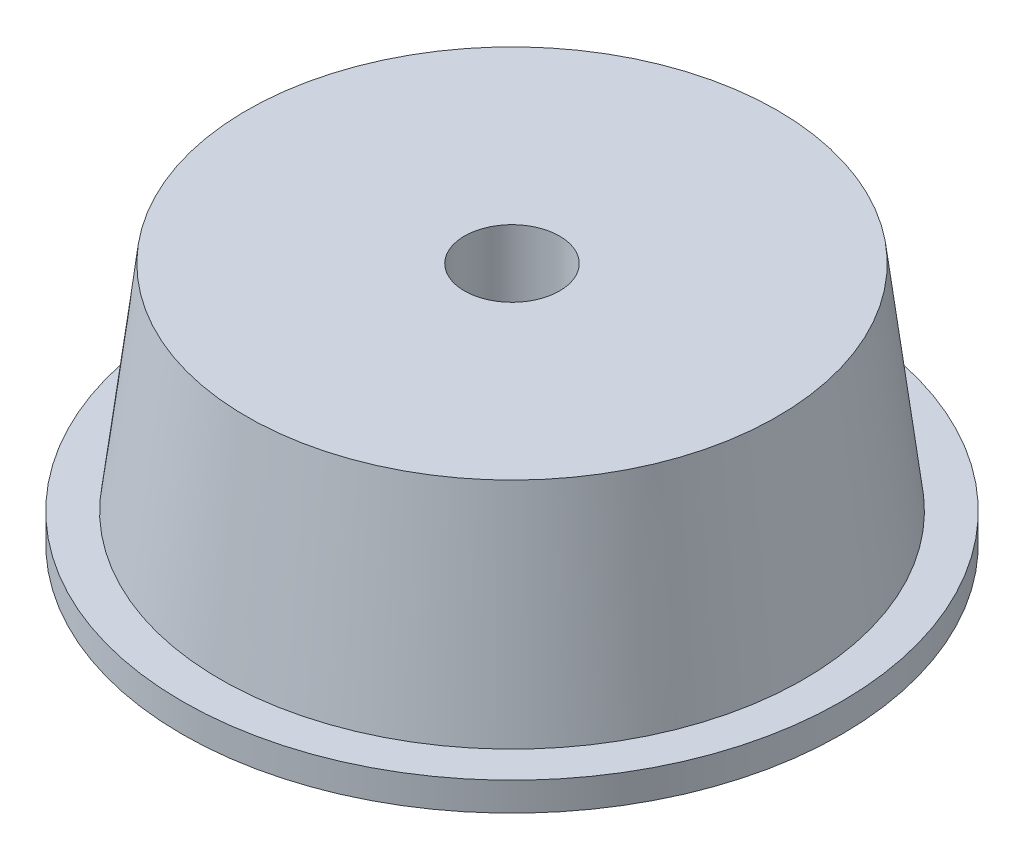
ISO-10303-21;
HEADER;
FILE_DESCRIPTION(('STEP AP214'),'2;1');
FILE_NAME('part.step','',(''),(''),'','','');
FILE_SCHEMA(('AUTOMOTIVE_DESIGN { 1 0 10303 214 1 1 1 1 }'));
ENDSEC;
DATA;
#1=APPLICATION_CONTEXT('core data for automotive mechanical design processes');
#2=APPLICATION_PROTOCOL_DEFINITION('international standard','automotive_design',2000,#1);
#3=PRODUCT_CONTEXT('',#1,'mechanical');
#4=PRODUCT('Part','Part','',(#3));
#5=PRODUCT_RELATED_PRODUCT_CATEGORY('part','',(#4));
#6=PRODUCT_DEFINITION_FORMATION('','',#4);
#7=PRODUCT_DEFINITION_CONTEXT('part definition',#1,'design');
#8=PRODUCT_DEFINITION('design','',#6,#7);
#9=PRODUCT_DEFINITION_SHAPE('','',#8);
#10=(LENGTH_UNIT() NAMED_UNIT(*) SI_UNIT(.MILLI.,.METRE.));
#11=(NAMED_UNIT(*) PLANE_ANGLE_UNIT() SI_UNIT($,.RADIAN.));
#12=(NAMED_UNIT(*) SI_UNIT($,.STERADIAN.) SOLID_ANGLE_UNIT());
#13=UNCERTAINTY_MEASURE_WITH_UNIT(LENGTH_MEASURE(1.E-05),#10,'distance_accuracy_value','');
#14=(GEOMETRIC_REPRESENTATION_CONTEXT(3) GLOBAL_UNCERTAINTY_ASSIGNED_CONTEXT((#13)) GLOBAL_UNIT_ASSIGNED_CONTEXT((#10,
#11,#12)) REPRESENTATION_CONTEXT('',''));
#15=CARTESIAN_POINT('',(0.,0.,0.));
#16=DIRECTION('',(0.,0.,1.));
#17=DIRECTION('',(1.,0.,0.));
#18=AXIS2_PLACEMENT_3D('',#15,#16,#17);
#19=CARTESIAN_POINT('',(0.,0.,7.));
#20=DIRECTION('',(0.,1.,0.));
#21=DIRECTION('',(0.,0.,1.));
#22=AXIS2_PLACEMENT_3D('',#19,#20,#21);
#23=PLANE('',#22);
#24=CARTESIAN_POINT('',(0.,0.,0.));
#25=DIRECTION('',(0.,-1.,0.));
#26=DIRECTION('',(0.,0.,-1.));
#27=AXIS2_PLACEMENT_3D('',#24,#25,#26);
#28=CIRCLE('',#27,2.5);
#29=CARTESIAN_POINT('',(0.,0.,-2.5));
#30=VERTEX_POINT('',#29);
#31=EDGE_CURVE('E62',#30,#30,#28,.T.);
#32=ORIENTED_EDGE('',*,*,#31,.F.);
#33=EDGE_LOOP('',(#32));
#34=FACE_BOUND('',#33,.T.);
#35=CARTESIAN_POINT('',(0.,0.,0.));
#36=DIRECTION('',(0.,-1.,0.));
#37=DIRECTION('',(0.,0.,-1.));
#38=AXIS2_PLACEMENT_3D('',#35,#36,#37);
#39=CIRCLE('',#38,7.);
#40=CARTESIAN_POINT('',(0.,0.,-7.));
#41=VERTEX_POINT('',#40);
#42=EDGE_CURVE('E98',#41,#41,#39,.T.);
#43=ORIENTED_EDGE('',*,*,#42,.T.);
#44=EDGE_LOOP('',(#43));
#45=FACE_BOUND('',#44,.T.);
#46=ADVANCED_FACE('F38',(#34,#45),#23,.F.);
#47=CARTESIAN_POINT('',(0.,0.,0.));
#48=DIRECTION('',(0.,-1.,0.));
#49=DIRECTION('',(0.,0.,-1.));
#50=AXIS2_PLACEMENT_3D('',#47,#48,#49);
#51=CYLINDRICAL_SURFACE('',#50,2.5);
#52=CARTESIAN_POINT('',(0.,5.,0.));
#53=DIRECTION('',(0.,-1.,0.));
#54=DIRECTION('',(0.,0.,-1.));
#55=AXIS2_PLACEMENT_3D('',#52,#53,#54);
#56=CIRCLE('',#55,2.5);
#57=CARTESIAN_POINT('',(0.,5.,-2.5));
#58=VERTEX_POINT('',#57);
#59=EDGE_CURVE('E66',#58,#58,#56,.T.);
#60=ORIENTED_EDGE('',*,*,#59,.F.);
#61=EDGE_LOOP('',(#60));
#62=FACE_BOUND('',#61,.T.);
#63=ORIENTED_EDGE('',*,*,#31,.T.);
#64=EDGE_LOOP('',(#63));
#65=FACE_BOUND('',#64,.T.);
#66=ADVANCED_FACE('F176',(#62,#65),#51,.F.);
#67=CARTESIAN_POINT('',(0.,5.,2.5));
#68=DIRECTION('',(0.,-1.,0.));
#69=DIRECTION('',(0.,0.,-1.));
#70=AXIS2_PLACEMENT_3D('',#67,#68,#69);
#71=PLANE('',#70);
#72=CARTESIAN_POINT('',(0.,5.,0.));
#73=DIRECTION('',(0.,-1.,0.));
#74=DIRECTION('',(0.,0.,-1.));
#75=AXIS2_PLACEMENT_3D('',#72,#73,#74);
#76=CIRCLE('',#75,5.);
#77=CARTESIAN_POINT('',(0.,5.,-5.));
#78=VERTEX_POINT('',#77);
#79=EDGE_CURVE('E70',#78,#78,#76,.T.);
#80=ORIENTED_EDGE('',*,*,#79,.F.);
#81=EDGE_LOOP('',(#80));
#82=FACE_BOUND('',#81,.T.);
#83=ORIENTED_EDGE('',*,*,#59,.T.);
#84=EDGE_LOOP('',(#83));
#85=FACE_BOUND('',#84,.T.);
#86=ADVANCED_FACE('F172',(#82,#85),#71,.F.);
#87=CARTESIAN_POINT('',(0.,0.,0.));
#88=DIRECTION('',(0.,-1.,0.));
#89=DIRECTION('',(0.,0.,-1.));
#90=AXIS2_PLACEMENT_3D('',#87,#88,#89);
#91=CYLINDRICAL_SURFACE('',#90,5.);
#92=CARTESIAN_POINT('',(0.,25.5284900350878,0.));
#93=DIRECTION('',(0.,-1.,0.));
#94=DIRECTION('',(0.,0.,-1.));
#95=AXIS2_PLACEMENT_3D('',#92,#93,#94);
#96=CIRCLE('',#95,5.);
#97=CARTESIAN_POINT('',(0.,25.5284900350878,-5.));
#98=VERTEX_POINT('',#97);
#99=EDGE_CURVE('E74',#98,#98,#96,.T.);
#100=ORIENTED_EDGE('',*,*,#99,.F.);
#101=EDGE_LOOP('',(#100));
#102=FACE_BOUND('',#101,.T.);
#103=ORIENTED_EDGE('',*,*,#79,.T.);
#104=EDGE_LOOP('',(#103));
#105=FACE_BOUND('',#104,.T.);
#106=ADVANCED_FACE('F168',(#102,#105),#91,.F.);
#107=CARTESIAN_POINT('',(0.,25.5284900350878,5.));
#108=DIRECTION('',(0.,-1.,0.));
#109=DIRECTION('',(0.,0.,-1.));
#110=AXIS2_PLACEMENT_3D('',#107,#108,#109);
#111=PLANE('',#110);
#112=CARTESIAN_POINT('',(0.,25.5284900350878,0.));
#113=DIRECTION('',(0.,-1.,0.));
#114=DIRECTION('',(0.,0.,-1.));
#115=AXIS2_PLACEMENT_3D('',#112,#113,#114);
#116=CIRCLE('',#115,27.8805152114454);
#117=CARTESIAN_POINT('',(0.,25.5284900350878,-27.8805152114454));
#118=VERTEX_POINT('',#117);
#119=EDGE_CURVE('E78',#118,#118,#116,.T.);
#120=ORIENTED_EDGE('',*,*,#119,.F.);
#121=EDGE_LOOP('',(#120));
#122=FACE_BOUND('',#121,.T.);
#123=ORIENTED_EDGE('',*,*,#99,.T.);
#124=EDGE_LOOP('',(#123));
#125=FACE_BOUND('',#124,.T.);
#126=ADVANCED_FACE('F164',(#122,#125),#111,.F.);
#127=CARTESIAN_POINT('',(0.,25.5284900350878,0.));
#128=DIRECTION('',(0.,-1.,0.));
#129=DIRECTION('',(0.,0.,-1.));
#130=AXIS2_PLACEMENT_3D('',#127,#128,#129);
#131=CONICAL_SURFACE('',#130,27.8805152114454,0.1221730476396);
#132=CARTESIAN_POINT('',(0.,3.,0.));
#133=DIRECTION('',(0.,-1.,0.));
#134=DIRECTION('',(0.,0.,-1.));
#135=AXIS2_PLACEMENT_3D('',#132,#133,#134);
#136=CIRCLE('',#135,30.646665968209);
#137=CARTESIAN_POINT('',(0.,3.,-30.646665968209));
#138=VERTEX_POINT('',#137);
#139=EDGE_CURVE('E82',#138,#138,#136,.T.);
#140=ORIENTED_EDGE('',*,*,#139,.F.);
#141=EDGE_LOOP('',(#140));
#142=FACE_BOUND('',#141,.T.);
#143=ORIENTED_EDGE('',*,*,#119,.T.);
#144=EDGE_LOOP('',(#143));
#145=FACE_BOUND('',#144,.T.);
#146=ADVANCED_FACE('F160',(#142,#145),#131,.T.);
#147=CARTESIAN_POINT('',(0.,3.,34.646665968209));
#148=DIRECTION('',(0.,-1.,0.));
#149=DIRECTION('',(0.,0.,-1.));
#150=AXIS2_PLACEMENT_3D('',#147,#148,#149);
#151=PLANE('',#150);
#152=CARTESIAN_POINT('',(0.,3.,0.));
#153=DIRECTION('',(0.,-1.,0.));
#154=DIRECTION('',(0.,0.,-1.));
#155=AXIS2_PLACEMENT_3D('',#152,#153,#154);
#156=CIRCLE('',#155,34.646665968209);
#157=CARTESIAN_POINT('',(0.,3.,-34.646665968209));
#158=VERTEX_POINT('',#157);
#159=EDGE_CURVE('E86',#158,#158,#156,.T.);
#160=ORIENTED_EDGE('',*,*,#159,.F.);
#161=EDGE_LOOP('',(#160));
#162=FACE_BOUND('',#161,.T.);
#163=ORIENTED_EDGE('',*,*,#139,.T.);
#164=EDGE_LOOP('',(#163));
#165=FACE_BOUND('',#164,.T.);
#166=ADVANCED_FACE('F156',(#162,#165),#151,.F.);
#167=CARTESIAN_POINT('',(0.,0.,0.));
#168=DIRECTION('',(0.,-1.,0.));
#169=DIRECTION('',(0.,0.,-1.));
#170=AXIS2_PLACEMENT_3D('',#167,#168,#169);
#171=CYLINDRICAL_SURFACE('',#170,34.646665968209);
#172=CARTESIAN_POINT('',(0.,0.,0.));
#173=DIRECTION('',(0.,-1.,0.));
#174=DIRECTION('',(0.,0.,-1.));
#175=AXIS2_PLACEMENT_3D('',#172,#173,#174);
#176=CIRCLE('',#175,34.646665968209);
#177=CARTESIAN_POINT('',(0.,0.,-34.646665968209));
#178=VERTEX_POINT('',#177);
#179=EDGE_CURVE('E90',#178,#178,#176,.T.);
#180=ORIENTED_EDGE('',*,*,#179,.F.);
#181=EDGE_LOOP('',(#180));
#182=FACE_BOUND('',#181,.T.);
#183=ORIENTED_EDGE('',*,*,#159,.T.);
#184=EDGE_LOOP('',(#183));
#185=FACE_BOUND('',#184,.T.);
#186=ADVANCED_FACE('F152',(#182,#185),#171,.T.);
#187=CARTESIAN_POINT('',(0.,0.,29.));
#188=DIRECTION('',(0.,1.,0.));
#189=DIRECTION('',(0.,0.,1.));
#190=AXIS2_PLACEMENT_3D('',#187,#188,#189);
#191=PLANE('',#190);
#192=CARTESIAN_POINT('',(0.,0.,0.));
#193=DIRECTION('',(0.,-1.,0.));
#194=DIRECTION('',(0.,0.,-1.));
#195=AXIS2_PLACEMENT_3D('',#192,#193,#194);
#196=CIRCLE('',#195,29.);
#197=CARTESIAN_POINT('',(0.,0.,-29.));
#198=VERTEX_POINT('',#197);
#199=EDGE_CURVE('E94',#198,#198,#196,.T.);
#200=ORIENTED_EDGE('',*,*,#199,.F.);
#201=EDGE_LOOP('',(#200));
#202=FACE_BOUND('',#201,.T.);
#203=ORIENTED_EDGE('',*,*,#179,.T.);
#204=EDGE_LOOP('',(#203));
#205=FACE_BOUND('',#204,.T.);
#206=ADVANCED_FACE('F148',(#202,#205),#191,.F.);
#207=CARTESIAN_POINT('',(0.,0.,0.));
#208=DIRECTION('',(0.,-1.,0.));
#209=DIRECTION('',(0.,0.,-1.));
#210=AXIS2_PLACEMENT_3D('',#207,#208,#209);
#211=CONICAL_SURFACE('',#210,29.,0.1221730476396);
#212=CARTESIAN_POINT('',(0.,16.503444782329,0.));
#213=DIRECTION('',(0.,-1.,0.));
#214=DIRECTION('',(0.,0.,-1.));
#215=AXIS2_PLACEMENT_3D('',#212,#213,#214);
#216=CIRCLE('',#215,26.9736317790165);
#217=CARTESIAN_POINT('',(0.,16.503444782329,-26.9736317790165));
#218=VERTEX_POINT('',#217);
#219=EDGE_CURVE('E51',#218,#218,#216,.F.);
#220=ORIENTED_EDGE('',*,*,#219,.T.);
#221=EDGE_LOOP('',(#220));
#222=FACE_BOUND('',#221,.T.);
#223=ORIENTED_EDGE('',*,*,#199,.T.);
#224=EDGE_LOOP('',(#223));
#225=FACE_BOUND('',#224,.T.);
#226=ADVANCED_FACE('F145',(#222,#225),#211,.F.);
#227=CARTESIAN_POINT('',(0.,23.5284900350878,7.));
#228=DIRECTION('',(0.,1.,0.));
#229=DIRECTION('',(0.,0.,1.));
#230=AXIS2_PLACEMENT_3D('',#227,#228,#229);
#231=PLANE('',#230);
#232=CARTESIAN_POINT('',(0.,23.5284900350878,0.));
#233=DIRECTION('',(0.,1.,0.));
#234=DIRECTION('',(0.,0.,1.));
#235=AXIS2_PLACEMENT_3D('',#232,#233,#234);
#236=CIRCLE('',#235,15.);
#237=CARTESIAN_POINT('',(0.,23.5284900350878,15.));
#238=VERTEX_POINT('',#237);
#239=EDGE_CURVE('E10',#238,#238,#236,.T.);
#240=ORIENTED_EDGE('',*,*,#239,.T.);
#241=EDGE_LOOP('',(#240));
#242=FACE_BOUND('',#241,.T.);
#243=CARTESIAN_POINT('',(0.,23.5284900350878,0.));
#244=DIRECTION('',(0.,1.,0.));
#245=DIRECTION('',(0.,0.,1.));
#246=AXIS2_PLACEMENT_3D('',#243,#244,#245);
#247=CIRCLE('',#246,19.0332625658859);
#248=CARTESIAN_POINT('',(0.,23.5284900350878,19.0332625658859));
#249=VERTEX_POINT('',#248);
#250=EDGE_CURVE('E56',#249,#249,#247,.F.);
#251=ORIENTED_EDGE('',*,*,#250,.T.);
#252=EDGE_LOOP('',(#251));
#253=FACE_BOUND('',#252,.T.);
#254=ADVANCED_FACE('F142',(#242,#253),#231,.F.);
#255=CARTESIAN_POINT('',(0.,0.,0.));
#256=DIRECTION('',(0.,-1.,0.));
#257=DIRECTION('',(0.,0.,-1.));
#258=AXIS2_PLACEMENT_3D('',#255,#256,#257);
#259=CYLINDRICAL_SURFACE('',#258,7.);
#260=CARTESIAN_POINT('',(0.,15.5284900350878,0.));
#261=DIRECTION('',(0.,1.,0.));
#262=DIRECTION('',(0.,0.,1.));
#263=AXIS2_PLACEMENT_3D('',#260,#261,#262);
#264=CIRCLE('',#263,7.);
#265=CARTESIAN_POINT('',(0.,15.5284900350878,7.));
#266=VERTEX_POINT('',#265);
#267=EDGE_CURVE('E46',#266,#266,#264,.F.);
#268=ORIENTED_EDGE('',*,*,#267,.T.);
#269=EDGE_LOOP('',(#268));
#270=FACE_BOUND('',#269,.T.);
#271=ORIENTED_EDGE('',*,*,#42,.F.);
#272=EDGE_LOOP('',(#271));
#273=FACE_BOUND('',#272,.T.);
#274=ADVANCED_FACE('F138',(#270,#273),#259,.T.);
#275=CARTESIAN_POINT('',(0.,15.5284900350878,0.));
#276=DIRECTION('',(0.,1.,0.));
#277=DIRECTION('',(0.,0.,1.));
#278=AXIS2_PLACEMENT_3D('',#275,#276,#277);
#279=TOROIDAL_SURFACE('',#278,19.0332625658859,8.);
#280=ORIENTED_EDGE('',*,*,#219,.F.);
#281=EDGE_LOOP('',(#280));
#282=FACE_BOUND('',#281,.T.);
#283=ORIENTED_EDGE('',*,*,#250,.F.);
#284=EDGE_LOOP('',(#283));
#285=FACE_BOUND('',#284,.T.);
#286=ADVANCED_FACE('F141',(#282,#285),#279,.F.);
#287=CARTESIAN_POINT('',(0.,15.5284900350878,0.));
#288=DIRECTION('',(0.,1.,0.));
#289=DIRECTION('',(0.,0.,1.));
#290=AXIS2_PLACEMENT_3D('',#287,#288,#289);
#291=TOROIDAL_SURFACE('',#290,15.,8.);
#292=ORIENTED_EDGE('',*,*,#239,.F.);
#293=EDGE_LOOP('',(#292));
#294=FACE_BOUND('',#293,.T.);
#295=ORIENTED_EDGE('',*,*,#267,.F.);
#296=EDGE_LOOP('',(#295));
#297=FACE_BOUND('',#296,.T.);
#298=ADVANCED_FACE('F40',(#294,#297),#291,.F.);
#299=CLOSED_SHELL('',(#46,#66,#86,#106,#126,#146,#166,#186,#206,#226,#254,#274,#286,#298));
#300=CARTESIAN_POINT('',(0.,2.,7.));
#301=DIRECTION('',(0.,1.,0.));
#302=DIRECTION('',(0.,0.,1.));
#303=AXIS2_PLACEMENT_3D('',#300,#301,#302);
#304=PLANE('',#303);
#305=CARTESIAN_POINT('',(0.,2.,0.));
#306=DIRECTION('',(0.,-1.,0.));
#307=DIRECTION('',(0.,0.,-1.));
#308=AXIS2_PLACEMENT_3D('',#305,#306,#307);
#309=CIRCLE('',#308,4.5);
#310=CARTESIAN_POINT('',(0.,2.,-4.5));
#311=VERTEX_POINT('',#310);
#312=EDGE_CURVE('E102',#311,#311,#309,.T.);
#313=ORIENTED_EDGE('',*,*,#312,.T.);
#314=EDGE_LOOP('',(#313));
#315=FACE_BOUND('',#314,.T.);
#316=CARTESIAN_POINT('',(0.,2.,0.));
#317=DIRECTION('',(0.,-1.,0.));
#318=DIRECTION('',(0.,0.,-1.));
#319=AXIS2_PLACEMENT_3D('',#316,#317,#318);
#320=CIRCLE('',#319,5.);
#321=CARTESIAN_POINT('',(0.,2.,-5.));
#322=VERTEX_POINT('',#321);
#323=EDGE_CURVE('E114',#322,#322,#320,.T.);
#324=ORIENTED_EDGE('',*,*,#323,.F.);
#325=EDGE_LOOP('',(#324));
#326=FACE_BOUND('',#325,.T.);
#327=ADVANCED_FACE('F122',(#315,#326),#304,.T.);
#328=CARTESIAN_POINT('',(0.,0.,0.));
#329=DIRECTION('',(0.,-1.,0.));
#330=DIRECTION('',(0.,0.,-1.));
#331=AXIS2_PLACEMENT_3D('',#328,#329,#330);
#332=CYLINDRICAL_SURFACE('',#331,4.5);
#333=CARTESIAN_POINT('',(0.,3.,0.));
#334=DIRECTION('',(0.,-1.,0.));
#335=DIRECTION('',(0.,0.,-1.));
#336=AXIS2_PLACEMENT_3D('',#333,#334,#335);
#337=CIRCLE('',#336,4.5);
#338=CARTESIAN_POINT('',(0.,3.,-4.5));
#339=VERTEX_POINT('',#338);
#340=EDGE_CURVE('E106',#339,#339,#337,.T.);
#341=ORIENTED_EDGE('',*,*,#340,.T.);
#342=EDGE_LOOP('',(#341));
#343=FACE_BOUND('',#342,.T.);
#344=ORIENTED_EDGE('',*,*,#312,.F.);
#345=EDGE_LOOP('',(#344));
#346=FACE_BOUND('',#345,.T.);
#347=ADVANCED_FACE('F124',(#343,#346),#332,.T.);
#348=CARTESIAN_POINT('',(0.,3.,2.5));
#349=DIRECTION('',(0.,-1.,0.));
#350=DIRECTION('',(0.,0.,-1.));
#351=AXIS2_PLACEMENT_3D('',#348,#349,#350);
#352=PLANE('',#351);
#353=CARTESIAN_POINT('',(0.,3.,0.));
#354=DIRECTION('',(0.,-1.,0.));
#355=DIRECTION('',(0.,0.,-1.));
#356=AXIS2_PLACEMENT_3D('',#353,#354,#355);
#357=CIRCLE('',#356,5.);
#358=CARTESIAN_POINT('',(0.,3.,-5.));
#359=VERTEX_POINT('',#358);
#360=EDGE_CURVE('E110',#359,#359,#357,.T.);
#361=ORIENTED_EDGE('',*,*,#360,.T.);
#362=EDGE_LOOP('',(#361));
#363=FACE_BOUND('',#362,.T.);
#364=ORIENTED_EDGE('',*,*,#340,.F.);
#365=EDGE_LOOP('',(#364));
#366=FACE_BOUND('',#365,.T.);
#367=ADVANCED_FACE('F132',(#363,#366),#352,.T.);
#368=CARTESIAN_POINT('',(0.,0.,0.));
#369=DIRECTION('',(0.,-1.,0.));
#370=DIRECTION('',(0.,0.,-1.));
#371=AXIS2_PLACEMENT_3D('',#368,#369,#370);
#372=CYLINDRICAL_SURFACE('',#371,5.);
#373=ORIENTED_EDGE('',*,*,#323,.T.);
#374=EDGE_LOOP('',(#373));
#375=FACE_BOUND('',#374,.T.);
#376=ORIENTED_EDGE('',*,*,#360,.F.);
#377=EDGE_LOOP('',(#376));
#378=FACE_BOUND('',#377,.T.);
#379=ADVANCED_FACE('F119',(#375,#378),#372,.F.);
#380=CLOSED_SHELL('',(#327,#347,#367,#379));
#381=ORIENTED_CLOSED_SHELL('',*,#380,.T.);
#382=BREP_WITH_VOIDS('B2',#299,(#381));
#383=ADVANCED_BREP_SHAPE_REPRESENTATION('',(#18,#382),#14);
#384=SHAPE_DEFINITION_REPRESENTATION(#9,#383);
ENDSEC;
END-ISO-10303-21;
